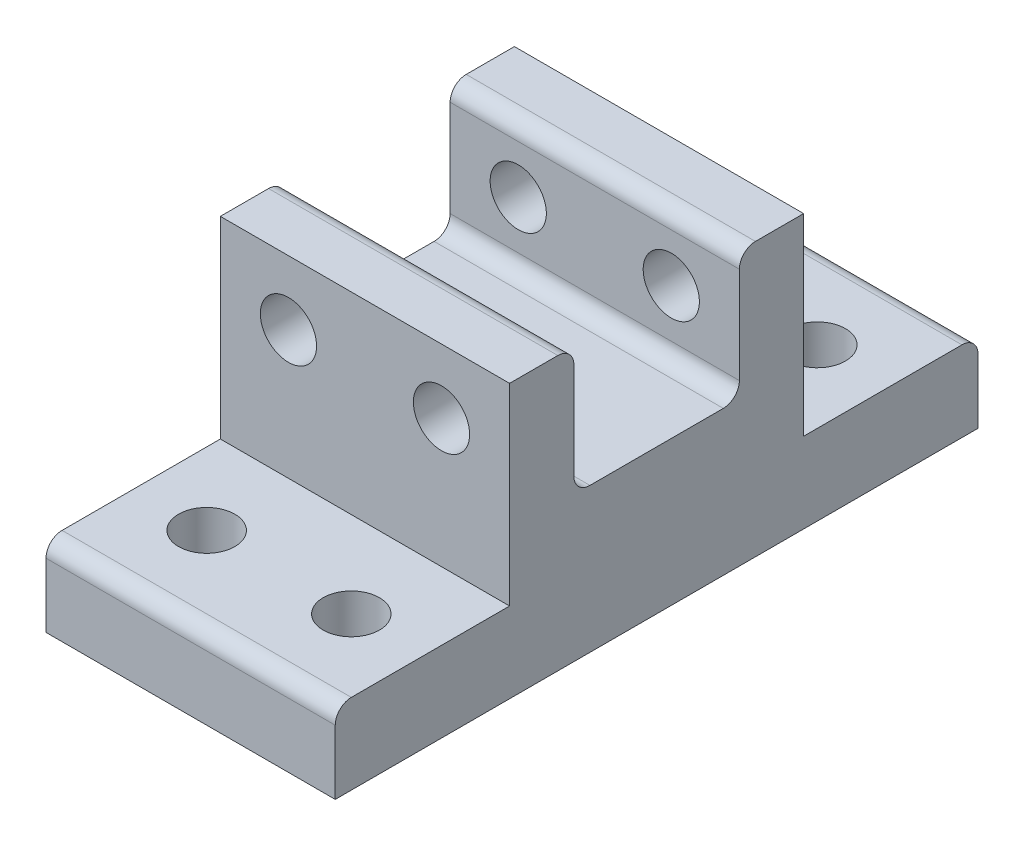
ISO-10303-21;
HEADER;
FILE_DESCRIPTION(('STEP AP214'),'2;1');
FILE_NAME('part.step','',(''),(''),'','','');
FILE_SCHEMA(('AUTOMOTIVE_DESIGN { 1 0 10303 214 1 1 1 1 }'));
ENDSEC;
DATA;
#1=APPLICATION_CONTEXT('core data for automotive mechanical design processes');
#2=APPLICATION_PROTOCOL_DEFINITION('international standard','automotive_design',2000,#1);
#3=PRODUCT_CONTEXT('',#1,'mechanical');
#4=PRODUCT('Part','Part','',(#3));
#5=PRODUCT_RELATED_PRODUCT_CATEGORY('part','',(#4));
#6=PRODUCT_DEFINITION_FORMATION('','',#4);
#7=PRODUCT_DEFINITION_CONTEXT('part definition',#1,'design');
#8=PRODUCT_DEFINITION('design','',#6,#7);
#9=PRODUCT_DEFINITION_SHAPE('','',#8);
#10=(LENGTH_UNIT() NAMED_UNIT(*) SI_UNIT(.MILLI.,.METRE.));
#11=(NAMED_UNIT(*) PLANE_ANGLE_UNIT() SI_UNIT($,.RADIAN.));
#12=(NAMED_UNIT(*) SI_UNIT($,.STERADIAN.) SOLID_ANGLE_UNIT());
#13=UNCERTAINTY_MEASURE_WITH_UNIT(LENGTH_MEASURE(1.E-05),#10,'distance_accuracy_value','');
#14=(GEOMETRIC_REPRESENTATION_CONTEXT(3) GLOBAL_UNCERTAINTY_ASSIGNED_CONTEXT((#13)) GLOBAL_UNIT_ASSIGNED_CONTEXT((#10,
#11,#12)) REPRESENTATION_CONTEXT('',''));
#15=CARTESIAN_POINT('',(0.,0.,0.));
#16=DIRECTION('',(0.,0.,1.));
#17=DIRECTION('',(1.,0.,0.));
#18=AXIS2_PLACEMENT_3D('',#15,#16,#17);
#19=CARTESIAN_POINT('',(0.,3.,0.));
#20=DIRECTION('',(0.,1.,0.));
#21=DIRECTION('',(0.,0.,1.));
#22=AXIS2_PLACEMENT_3D('',#19,#20,#21);
#23=PLANE('',#22);
#24=DIRECTION('',(0.,0.,-1.));
#25=VECTOR('',#24,1.);
#26=CARTESIAN_POINT('',(9.00000000000001,3.,9.15));
#27=LINE('',#26,#25);
#28=CARTESIAN_POINT('',(9.00000000000001,3.,4.15));
#29=VERTEX_POINT('',#28);
#30=CARTESIAN_POINT('',(9.00000000000001,3.,-4.15));
#31=VERTEX_POINT('',#30);
#32=EDGE_CURVE('E238',#29,#31,#27,.T.);
#33=ORIENTED_EDGE('',*,*,#32,.T.);
#34=DIRECTION('',(1.,0.,0.));
#35=VECTOR('',#34,1.);
#36=CARTESIAN_POINT('',(0.,3.,-4.15));
#37=LINE('',#36,#35);
#38=CARTESIAN_POINT('',(-8.99999999999999,3.,-4.15));
#39=VERTEX_POINT('',#38);
#40=EDGE_CURVE('E271',#31,#39,#37,.F.);
#41=ORIENTED_EDGE('',*,*,#40,.T.);
#42=DIRECTION('',(0.,0.,-1.));
#43=VECTOR('',#42,1.);
#44=CARTESIAN_POINT('',(-8.99999999999999,3.,9.15));
#45=LINE('',#44,#43);
#46=CARTESIAN_POINT('',(-8.99999999999999,3.,4.15));
#47=VERTEX_POINT('',#46);
#48=EDGE_CURVE('E241',#47,#39,#45,.T.);
#49=ORIENTED_EDGE('',*,*,#48,.F.);
#50=DIRECTION('',(-1.,0.,0.));
#51=VECTOR('',#50,1.);
#52=CARTESIAN_POINT('',(0.,3.,4.15));
#53=LINE('',#52,#51);
#54=EDGE_CURVE('E261',#47,#29,#53,.F.);
#55=ORIENTED_EDGE('',*,*,#54,.T.);
#56=EDGE_LOOP('',(#33,#41,#49,#55));
#57=FACE_BOUND('',#56,.T.);
#58=ADVANCED_FACE('F35',(#57),#23,.T.);
#59=CARTESIAN_POINT('',(-8.99999999999999,3.,-9.15));
#60=DIRECTION('',(0.,0.,-1.));
#61=DIRECTION('',(-1.,0.,0.));
#62=AXIS2_PLACEMENT_3D('',#59,#60,#61);
#63=PLANE('',#62);
#64=CARTESIAN_POINT('',(4.762,7.,-9.15));
#65=DIRECTION('',(0.,0.,-1.));
#66=DIRECTION('',(-1.,0.,0.));
#67=AXIS2_PLACEMENT_3D('',#64,#65,#66);
#68=CIRCLE('',#67,1.75);
#69=CARTESIAN_POINT('',(3.012,7.,-9.15));
#70=VERTEX_POINT('',#69);
#71=EDGE_CURVE('E211',#70,#70,#68,.F.);
#72=ORIENTED_EDGE('',*,*,#71,.T.);
#73=EDGE_LOOP('',(#72));
#74=FACE_BOUND('',#73,.T.);
#75=CARTESIAN_POINT('',(-4.76200000000001,7.,-9.15));
#76=DIRECTION('',(0.,0.,-1.));
#77=DIRECTION('',(-1.,0.,0.));
#78=AXIS2_PLACEMENT_3D('',#75,#76,#77);
#79=CIRCLE('',#78,1.75);
#80=CARTESIAN_POINT('',(-6.51200000000001,7.,-9.15));
#81=VERTEX_POINT('',#80);
#82=EDGE_CURVE('E201',#81,#81,#79,.F.);
#83=ORIENTED_EDGE('',*,*,#82,.T.);
#84=EDGE_LOOP('',(#83));
#85=FACE_BOUND('',#84,.T.);
#86=DIRECTION('',(0.,-1.,0.));
#87=VECTOR('',#86,1.);
#88=CARTESIAN_POINT('',(9.00000000000001,3.,-9.15));
#89=LINE('',#88,#87);
#90=CARTESIAN_POINT('',(9.00000000000001,11.,-9.15));
#91=VERTEX_POINT('',#90);
#92=CARTESIAN_POINT('',(9.,-1.,-9.15));
#93=VERTEX_POINT('',#92);
#94=EDGE_CURVE('E244',#91,#93,#89,.T.);
#95=ORIENTED_EDGE('',*,*,#94,.T.);
#96=DIRECTION('',(1.,0.,0.));
#97=VECTOR('',#96,1.);
#98=CARTESIAN_POINT('',(-9.,-1.,-9.15));
#99=LINE('',#98,#97);
#100=CARTESIAN_POINT('',(-9.,-1.,-9.15));
#101=VERTEX_POINT('',#100);
#102=EDGE_CURVE('E186',#101,#93,#99,.T.);
#103=ORIENTED_EDGE('',*,*,#102,.F.);
#104=DIRECTION('',(0.,-1.,0.));
#105=VECTOR('',#104,1.);
#106=CARTESIAN_POINT('',(-8.99999999999999,3.,-9.15));
#107=LINE('',#106,#105);
#108=CARTESIAN_POINT('',(-8.99999999999999,11.,-9.15));
#109=VERTEX_POINT('',#108);
#110=EDGE_CURVE('E245',#109,#101,#107,.T.);
#111=ORIENTED_EDGE('',*,*,#110,.F.);
#112=DIRECTION('',(-1.,0.,0.));
#113=VECTOR('',#112,1.);
#114=CARTESIAN_POINT('',(9.00000000000001,11.,-9.15));
#115=LINE('',#114,#113);
#116=EDGE_CURVE('E216',#91,#109,#115,.T.);
#117=ORIENTED_EDGE('',*,*,#116,.F.);
#118=EDGE_LOOP('',(#95,#103,#111,#117));
#119=FACE_BOUND('',#118,.T.);
#120=ADVANCED_FACE('F335',(#74,#85,#119),#63,.T.);
#121=CARTESIAN_POINT('',(-8.99999999999999,3.,9.15));
#122=DIRECTION('',(-1.,0.,0.));
#123=DIRECTION('',(0.,0.,1.));
#124=AXIS2_PLACEMENT_3D('',#121,#122,#123);
#125=PLANE('',#124);
#126=DIRECTION('',(0.,1.,0.));
#127=VECTOR('',#126,1.);
#128=CARTESIAN_POINT('',(-9.,-6.,20.));
#129=LINE('',#128,#127);
#130=CARTESIAN_POINT('',(-9.,-6.,20.));
#131=VERTEX_POINT('',#130);
#132=CARTESIAN_POINT('',(-9.,-2.,20.));
#133=VERTEX_POINT('',#132);
#134=EDGE_CURVE('E166',#131,#133,#129,.T.);
#135=ORIENTED_EDGE('',*,*,#134,.T.);
#136=CARTESIAN_POINT('',(-8.99999999999999,-2.,19.));
#137=DIRECTION('',(-1.,0.,0.));
#138=DIRECTION('',(0.,0.,1.));
#139=AXIS2_PLACEMENT_3D('',#136,#137,#138);
#140=CIRCLE('',#139,1.);
#141=CARTESIAN_POINT('',(-9.,-1.,19.));
#142=VERTEX_POINT('',#141);
#143=EDGE_CURVE('E57',#133,#142,#140,.T.);
#144=ORIENTED_EDGE('',*,*,#143,.T.);
#145=DIRECTION('',(0.,0.,-1.));
#146=VECTOR('',#145,1.);
#147=CARTESIAN_POINT('',(-9.,-1.,20.));
#148=LINE('',#147,#146);
#149=CARTESIAN_POINT('',(-9.,-1.,9.15));
#150=VERTEX_POINT('',#149);
#151=EDGE_CURVE('E179',#142,#150,#148,.T.);
#152=ORIENTED_EDGE('',*,*,#151,.T.);
#153=DIRECTION('',(0.,-1.,0.));
#154=VECTOR('',#153,1.);
#155=CARTESIAN_POINT('',(-8.99999999999999,3.,9.15));
#156=LINE('',#155,#154);
#157=CARTESIAN_POINT('',(-8.99999999999999,11.,9.15));
#158=VERTEX_POINT('',#157);
#159=EDGE_CURVE('E248',#158,#150,#156,.T.);
#160=ORIENTED_EDGE('',*,*,#159,.F.);
#161=DIRECTION('',(0.,0.,1.));
#162=VECTOR('',#161,1.);
#163=CARTESIAN_POINT('',(-8.99999999999999,11.,9.15));
#164=LINE('',#163,#162);
#165=CARTESIAN_POINT('',(-8.99999999999999,11.,6.15));
#166=VERTEX_POINT('',#165);
#167=EDGE_CURVE('E229',#166,#158,#164,.T.);
#168=ORIENTED_EDGE('',*,*,#167,.F.);
#169=CARTESIAN_POINT('',(-8.99999999999999,10.,6.15));
#170=DIRECTION('',(-1.,0.,0.));
#171=DIRECTION('',(0.,0.,1.));
#172=AXIS2_PLACEMENT_3D('',#169,#170,#171);
#173=CIRCLE('',#172,1.);
#174=CARTESIAN_POINT('',(-8.99999999999999,10.,5.15));
#175=VERTEX_POINT('',#174);
#176=EDGE_CURVE('E287',#166,#175,#173,.T.);
#177=ORIENTED_EDGE('',*,*,#176,.T.);
#178=DIRECTION('',(0.,-1.,0.));
#179=VECTOR('',#178,1.);
#180=CARTESIAN_POINT('',(-8.99999999999999,11.,5.15));
#181=LINE('',#180,#179);
#182=CARTESIAN_POINT('',(-8.99999999999999,4.,5.15));
#183=VERTEX_POINT('',#182);
#184=EDGE_CURVE('E234',#175,#183,#181,.T.);
#185=ORIENTED_EDGE('',*,*,#184,.T.);
#186=CARTESIAN_POINT('',(-8.99999999999999,4.,4.15));
#187=DIRECTION('',(-1.,0.,0.));
#188=DIRECTION('',(0.,0.,1.));
#189=AXIS2_PLACEMENT_3D('',#186,#187,#188);
#190=CIRCLE('',#189,1.);
#191=EDGE_CURVE('E263',#183,#47,#190,.F.);
#192=ORIENTED_EDGE('',*,*,#191,.T.);
#193=ORIENTED_EDGE('',*,*,#48,.T.);
#194=CARTESIAN_POINT('',(-8.99999999999999,4.,-4.15));
#195=DIRECTION('',(-1.,0.,0.));
#196=DIRECTION('',(0.,0.,1.));
#197=AXIS2_PLACEMENT_3D('',#194,#195,#196);
#198=CIRCLE('',#197,1.);
#199=CARTESIAN_POINT('',(-8.99999999999999,4.,-5.15));
#200=VERTEX_POINT('',#199);
#201=EDGE_CURVE('E275',#39,#200,#198,.F.);
#202=ORIENTED_EDGE('',*,*,#201,.T.);
#203=DIRECTION('',(0.,-1.,0.));
#204=VECTOR('',#203,1.);
#205=CARTESIAN_POINT('',(-8.99999999999999,11.,-5.15));
#206=LINE('',#205,#204);
#207=CARTESIAN_POINT('',(-8.99999999999999,10.,-5.15));
#208=VERTEX_POINT('',#207);
#209=EDGE_CURVE('E224',#208,#200,#206,.T.);
#210=ORIENTED_EDGE('',*,*,#209,.F.);
#211=CARTESIAN_POINT('',(-8.99999999999999,10.,-6.15));
#212=DIRECTION('',(-1.,0.,0.));
#213=DIRECTION('',(0.,0.,1.));
#214=AXIS2_PLACEMENT_3D('',#211,#212,#213);
#215=CIRCLE('',#214,1.);
#216=CARTESIAN_POINT('',(-8.99999999999999,11.,-6.15));
#217=VERTEX_POINT('',#216);
#218=EDGE_CURVE('E289',#208,#217,#215,.T.);
#219=ORIENTED_EDGE('',*,*,#218,.T.);
#220=DIRECTION('',(0.,0.,1.));
#221=VECTOR('',#220,1.);
#222=CARTESIAN_POINT('',(-8.99999999999999,11.,-9.15));
#223=LINE('',#222,#221);
#224=EDGE_CURVE('E219',#109,#217,#223,.T.);
#225=ORIENTED_EDGE('',*,*,#224,.F.);
#226=ORIENTED_EDGE('',*,*,#110,.T.);
#227=CARTESIAN_POINT('',(-9.,-1.,-19.));
#228=VERTEX_POINT('',#227);
#229=EDGE_CURVE('E317',#101,#228,#148,.T.);
#230=ORIENTED_EDGE('',*,*,#229,.T.);
#231=CARTESIAN_POINT('',(-8.99999999999999,-2.,-19.));
#232=DIRECTION('',(-1.,0.,0.));
#233=DIRECTION('',(0.,0.,1.));
#234=AXIS2_PLACEMENT_3D('',#231,#232,#233);
#235=CIRCLE('',#234,1.);
#236=CARTESIAN_POINT('',(-9.,-2.,-20.));
#237=VERTEX_POINT('',#236);
#238=EDGE_CURVE('E303',#228,#237,#235,.T.);
#239=ORIENTED_EDGE('',*,*,#238,.T.);
#240=DIRECTION('',(0.,1.,0.));
#241=VECTOR('',#240,1.);
#242=CARTESIAN_POINT('',(-9.,-6.,-20.));
#243=LINE('',#242,#241);
#244=CARTESIAN_POINT('',(-9.,-6.,-20.));
#245=VERTEX_POINT('',#244);
#246=EDGE_CURVE('E188',#245,#237,#243,.T.);
#247=ORIENTED_EDGE('',*,*,#246,.F.);
#248=DIRECTION('',(0.,0.,-1.));
#249=VECTOR('',#248,1.);
#250=CARTESIAN_POINT('',(-9.,-6.,20.));
#251=LINE('',#250,#249);
#252=EDGE_CURVE('E169',#131,#245,#251,.T.);
#253=ORIENTED_EDGE('',*,*,#252,.F.);
#254=EDGE_LOOP('',(#135,#144,#152,#160,#168,#177,#185,#192,#193,#202,#210,#219,#225,#226,#230,
#239,#247,#253));
#255=FACE_BOUND('',#254,.T.);
#256=ADVANCED_FACE('F308',(#255),#125,.T.);
#257=CARTESIAN_POINT('',(-8.99999999999999,3.,9.15));
#258=DIRECTION('',(0.,0.,-1.));
#259=DIRECTION('',(-1.,0.,0.));
#260=AXIS2_PLACEMENT_3D('',#257,#258,#259);
#261=PLANE('',#260);
#262=CARTESIAN_POINT('',(4.762,7.,9.15));
#263=DIRECTION('',(0.,0.,-1.));
#264=DIRECTION('',(-1.,0.,0.));
#265=AXIS2_PLACEMENT_3D('',#262,#263,#264);
#266=CIRCLE('',#265,1.75);
#267=CARTESIAN_POINT('',(3.01200000000001,7.,9.15));
#268=VERTEX_POINT('',#267);
#269=EDGE_CURVE('E208',#268,#268,#266,.F.);
#270=ORIENTED_EDGE('',*,*,#269,.F.);
#271=EDGE_LOOP('',(#270));
#272=FACE_BOUND('',#271,.T.);
#273=CARTESIAN_POINT('',(-4.762,7.,9.15));
#274=DIRECTION('',(0.,0.,-1.));
#275=DIRECTION('',(-1.,0.,0.));
#276=AXIS2_PLACEMENT_3D('',#273,#274,#275);
#277=CIRCLE('',#276,1.75);
#278=CARTESIAN_POINT('',(-6.512,7.,9.15));
#279=VERTEX_POINT('',#278);
#280=EDGE_CURVE('E198',#279,#279,#277,.F.);
#281=ORIENTED_EDGE('',*,*,#280,.F.);
#282=EDGE_LOOP('',(#281));
#283=FACE_BOUND('',#282,.T.);
#284=ORIENTED_EDGE('',*,*,#159,.T.);
#285=DIRECTION('',(-1.,0.,0.));
#286=VECTOR('',#285,1.);
#287=CARTESIAN_POINT('',(-9.,-1.,9.15));
#288=LINE('',#287,#286);
#289=CARTESIAN_POINT('',(9.00000000000001,-1.,9.15));
#290=VERTEX_POINT('',#289);
#291=EDGE_CURVE('E183',#290,#150,#288,.T.);
#292=ORIENTED_EDGE('',*,*,#291,.F.);
#293=DIRECTION('',(0.,-1.,0.));
#294=VECTOR('',#293,1.);
#295=CARTESIAN_POINT('',(9.00000000000001,3.,9.15));
#296=LINE('',#295,#294);
#297=CARTESIAN_POINT('',(9.00000000000001,11.,9.15));
#298=VERTEX_POINT('',#297);
#299=EDGE_CURVE('E251',#298,#290,#296,.T.);
#300=ORIENTED_EDGE('',*,*,#299,.F.);
#301=DIRECTION('',(1.,0.,0.));
#302=VECTOR('',#301,1.);
#303=CARTESIAN_POINT('',(9.00000000000001,11.,9.15));
#304=LINE('',#303,#302);
#305=EDGE_CURVE('E231',#158,#298,#304,.T.);
#306=ORIENTED_EDGE('',*,*,#305,.F.);
#307=EDGE_LOOP('',(#284,#292,#300,#306));
#308=FACE_BOUND('',#307,.T.);
#309=ADVANCED_FACE('F381',(#272,#283,#308),#261,.F.);
#310=CARTESIAN_POINT('',(9.00000000000001,3.,9.15));
#311=DIRECTION('',(-1.,0.,0.));
#312=DIRECTION('',(0.,0.,1.));
#313=AXIS2_PLACEMENT_3D('',#310,#311,#312);
#314=PLANE('',#313);
#315=DIRECTION('',(0.,0.,1.));
#316=VECTOR('',#315,1.);
#317=CARTESIAN_POINT('',(9.,-1.,20.));
#318=LINE('',#317,#316);
#319=CARTESIAN_POINT('',(9.,-1.,19.));
#320=VERTEX_POINT('',#319);
#321=EDGE_CURVE('E318',#290,#320,#318,.T.);
#322=ORIENTED_EDGE('',*,*,#321,.T.);
#323=CARTESIAN_POINT('',(9.,-2.,19.));
#324=DIRECTION('',(-1.,0.,0.));
#325=DIRECTION('',(0.,0.,1.));
#326=AXIS2_PLACEMENT_3D('',#323,#324,#325);
#327=CIRCLE('',#326,1.);
#328=CARTESIAN_POINT('',(9.,-2.,20.));
#329=VERTEX_POINT('',#328);
#330=EDGE_CURVE('E12',#320,#329,#327,.F.);
#331=ORIENTED_EDGE('',*,*,#330,.T.);
#332=DIRECTION('',(0.,1.,0.));
#333=VECTOR('',#332,1.);
#334=CARTESIAN_POINT('',(9.,-6.,20.));
#335=LINE('',#334,#333);
#336=CARTESIAN_POINT('',(9.,-6.,20.));
#337=VERTEX_POINT('',#336);
#338=EDGE_CURVE('E164',#337,#329,#335,.T.);
#339=ORIENTED_EDGE('',*,*,#338,.F.);
#340=DIRECTION('',(0.,0.,1.));
#341=VECTOR('',#340,1.);
#342=CARTESIAN_POINT('',(9.,-6.,20.));
#343=LINE('',#342,#341);
#344=CARTESIAN_POINT('',(9.,-6.,-20.));
#345=VERTEX_POINT('',#344);
#346=EDGE_CURVE('E170',#345,#337,#343,.T.);
#347=ORIENTED_EDGE('',*,*,#346,.F.);
#348=DIRECTION('',(0.,1.,0.));
#349=VECTOR('',#348,1.);
#350=CARTESIAN_POINT('',(9.,-6.,-20.));
#351=LINE('',#350,#349);
#352=CARTESIAN_POINT('',(9.,-2.,-20.));
#353=VERTEX_POINT('',#352);
#354=EDGE_CURVE('E312',#345,#353,#351,.T.);
#355=ORIENTED_EDGE('',*,*,#354,.T.);
#356=CARTESIAN_POINT('',(9.,-2.,-19.));
#357=DIRECTION('',(-1.,0.,0.));
#358=DIRECTION('',(0.,0.,1.));
#359=AXIS2_PLACEMENT_3D('',#356,#357,#358);
#360=CIRCLE('',#359,1.);
#361=CARTESIAN_POINT('',(9.,-1.,-19.));
#362=VERTEX_POINT('',#361);
#363=EDGE_CURVE('E299',#353,#362,#360,.F.);
#364=ORIENTED_EDGE('',*,*,#363,.T.);
#365=EDGE_CURVE('E315',#362,#93,#318,.T.);
#366=ORIENTED_EDGE('',*,*,#365,.T.);
#367=ORIENTED_EDGE('',*,*,#94,.F.);
#368=DIRECTION('',(0.,0.,-1.));
#369=VECTOR('',#368,1.);
#370=CARTESIAN_POINT('',(9.00000000000001,11.,-9.15));
#371=LINE('',#370,#369);
#372=CARTESIAN_POINT('',(9.00000000000001,11.,-6.15));
#373=VERTEX_POINT('',#372);
#374=EDGE_CURVE('E214',#373,#91,#371,.T.);
#375=ORIENTED_EDGE('',*,*,#374,.F.);
#376=CARTESIAN_POINT('',(9.00000000000001,10.,-6.15));
#377=DIRECTION('',(-1.,0.,0.));
#378=DIRECTION('',(0.,0.,1.));
#379=AXIS2_PLACEMENT_3D('',#376,#377,#378);
#380=CIRCLE('',#379,1.);
#381=CARTESIAN_POINT('',(9.00000000000001,10.,-5.15));
#382=VERTEX_POINT('',#381);
#383=EDGE_CURVE('E283',#373,#382,#380,.F.);
#384=ORIENTED_EDGE('',*,*,#383,.T.);
#385=DIRECTION('',(0.,-1.,0.));
#386=VECTOR('',#385,1.);
#387=CARTESIAN_POINT('',(9.00000000000001,11.,-5.15));
#388=LINE('',#387,#386);
#389=CARTESIAN_POINT('',(9.00000000000001,4.,-5.15));
#390=VERTEX_POINT('',#389);
#391=EDGE_CURVE('E222',#382,#390,#388,.T.);
#392=ORIENTED_EDGE('',*,*,#391,.T.);
#393=CARTESIAN_POINT('',(9.00000000000001,4.,-4.15));
#394=DIRECTION('',(-1.,0.,0.));
#395=DIRECTION('',(0.,0.,1.));
#396=AXIS2_PLACEMENT_3D('',#393,#394,#395);
#397=CIRCLE('',#396,1.);
#398=EDGE_CURVE('E273',#390,#31,#397,.T.);
#399=ORIENTED_EDGE('',*,*,#398,.T.);
#400=ORIENTED_EDGE('',*,*,#32,.F.);
#401=CARTESIAN_POINT('',(9.00000000000001,4.,4.15));
#402=DIRECTION('',(-1.,0.,0.));
#403=DIRECTION('',(0.,0.,1.));
#404=AXIS2_PLACEMENT_3D('',#401,#402,#403);
#405=CIRCLE('',#404,1.);
#406=CARTESIAN_POINT('',(9.00000000000001,4.,5.15));
#407=VERTEX_POINT('',#406);
#408=EDGE_CURVE('E265',#29,#407,#405,.T.);
#409=ORIENTED_EDGE('',*,*,#408,.T.);
#410=DIRECTION('',(0.,-1.,0.));
#411=VECTOR('',#410,1.);
#412=CARTESIAN_POINT('',(9.00000000000001,11.,5.15));
#413=LINE('',#412,#411);
#414=CARTESIAN_POINT('',(9.00000000000001,10.,5.15));
#415=VERTEX_POINT('',#414);
#416=EDGE_CURVE('E236',#415,#407,#413,.T.);
#417=ORIENTED_EDGE('',*,*,#416,.F.);
#418=CARTESIAN_POINT('',(9.00000000000001,10.,6.15));
#419=DIRECTION('',(-1.,0.,0.));
#420=DIRECTION('',(0.,0.,1.));
#421=AXIS2_PLACEMENT_3D('',#418,#419,#420);
#422=CIRCLE('',#421,1.);
#423=CARTESIAN_POINT('',(9.00000000000001,11.,6.15));
#424=VERTEX_POINT('',#423);
#425=EDGE_CURVE('E281',#415,#424,#422,.F.);
#426=ORIENTED_EDGE('',*,*,#425,.T.);
#427=DIRECTION('',(0.,0.,-1.));
#428=VECTOR('',#427,1.);
#429=CARTESIAN_POINT('',(9.00000000000001,11.,9.15));
#430=LINE('',#429,#428);
#431=EDGE_CURVE('E226',#298,#424,#430,.T.);
#432=ORIENTED_EDGE('',*,*,#431,.F.);
#433=ORIENTED_EDGE('',*,*,#299,.T.);
#434=EDGE_LOOP('',(#322,#331,#339,#347,#355,#364,#366,#367,#375,#384,#392,#399,#400,#409,#417,
#426,#432,#433));
#435=FACE_BOUND('',#434,.T.);
#436=ADVANCED_FACE('F181',(#435),#314,.F.);
#437=CARTESIAN_POINT('',(9.00000000000001,11.,5.15));
#438=DIRECTION('',(0.,0.,1.));
#439=DIRECTION('',(1.,0.,0.));
#440=AXIS2_PLACEMENT_3D('',#437,#438,#439);
#441=PLANE('',#440);
#442=CARTESIAN_POINT('',(4.762,7.,5.15));
#443=DIRECTION('',(0.,0.,1.));
#444=DIRECTION('',(1.,0.,0.));
#445=AXIS2_PLACEMENT_3D('',#442,#443,#444);
#446=CIRCLE('',#445,1.75);
#447=CARTESIAN_POINT('',(6.512,7.,5.15));
#448=VERTEX_POINT('',#447);
#449=EDGE_CURVE('E205',#448,#448,#446,.F.);
#450=ORIENTED_EDGE('',*,*,#449,.F.);
#451=EDGE_LOOP('',(#450));
#452=FACE_BOUND('',#451,.T.);
#453=CARTESIAN_POINT('',(-4.762,7.,5.15));
#454=DIRECTION('',(0.,0.,1.));
#455=DIRECTION('',(1.,0.,0.));
#456=AXIS2_PLACEMENT_3D('',#453,#454,#455);
#457=CIRCLE('',#456,1.75);
#458=CARTESIAN_POINT('',(-3.012,7.,5.15));
#459=VERTEX_POINT('',#458);
#460=EDGE_CURVE('E195',#459,#459,#457,.F.);
#461=ORIENTED_EDGE('',*,*,#460,.F.);
#462=EDGE_LOOP('',(#461));
#463=FACE_BOUND('',#462,.T.);
#464=ORIENTED_EDGE('',*,*,#184,.F.);
#465=DIRECTION('',(-1.,0.,0.));
#466=VECTOR('',#465,1.);
#467=CARTESIAN_POINT('',(9.00000000000001,10.,5.15));
#468=LINE('',#467,#466);
#469=EDGE_CURVE('E294',#175,#415,#468,.F.);
#470=ORIENTED_EDGE('',*,*,#469,.T.);
#471=ORIENTED_EDGE('',*,*,#416,.T.);
#472=DIRECTION('',(-1.,0.,0.));
#473=VECTOR('',#472,1.);
#474=CARTESIAN_POINT('',(9.00000000000001,4.,5.15));
#475=LINE('',#474,#473);
#476=EDGE_CURVE('E247',#407,#183,#475,.T.);
#477=ORIENTED_EDGE('',*,*,#476,.T.);
#478=EDGE_LOOP('',(#464,#470,#471,#477));
#479=FACE_BOUND('',#478,.T.);
#480=ADVANCED_FACE('F441',(#452,#463,#479),#441,.F.);
#481=CARTESIAN_POINT('',(0.,11.,0.));
#482=DIRECTION('',(0.,1.,0.));
#483=DIRECTION('',(0.,0.,1.));
#484=AXIS2_PLACEMENT_3D('',#481,#482,#483);
#485=PLANE('',#484);
#486=ORIENTED_EDGE('',*,*,#431,.T.);
#487=DIRECTION('',(-1.,0.,0.));
#488=VECTOR('',#487,1.);
#489=CARTESIAN_POINT('',(-8.99999999999999,11.,6.15));
#490=LINE('',#489,#488);
#491=EDGE_CURVE('E291',#424,#166,#490,.T.);
#492=ORIENTED_EDGE('',*,*,#491,.T.);
#493=ORIENTED_EDGE('',*,*,#167,.T.);
#494=ORIENTED_EDGE('',*,*,#305,.T.);
#495=EDGE_LOOP('',(#486,#492,#493,#494));
#496=FACE_BOUND('',#495,.T.);
#497=ADVANCED_FACE('F375',(#496),#485,.T.);
#498=CARTESIAN_POINT('',(9.00000000000001,11.,-5.15));
#499=DIRECTION('',(0.,0.,-1.));
#500=DIRECTION('',(-1.,0.,0.));
#501=AXIS2_PLACEMENT_3D('',#498,#499,#500);
#502=PLANE('',#501);
#503=CARTESIAN_POINT('',(4.762,7.,-5.15));
#504=DIRECTION('',(0.,0.,-1.));
#505=DIRECTION('',(-1.,0.,0.));
#506=AXIS2_PLACEMENT_3D('',#503,#504,#505);
#507=CIRCLE('',#506,1.75);
#508=CARTESIAN_POINT('',(3.012,7.,-5.15));
#509=VERTEX_POINT('',#508);
#510=EDGE_CURVE('E204',#509,#509,#507,.F.);
#511=ORIENTED_EDGE('',*,*,#510,.F.);
#512=EDGE_LOOP('',(#511));
#513=FACE_BOUND('',#512,.T.);
#514=CARTESIAN_POINT('',(-4.762,7.,-5.15));
#515=DIRECTION('',(0.,0.,-1.));
#516=DIRECTION('',(-1.,0.,0.));
#517=AXIS2_PLACEMENT_3D('',#514,#515,#516);
#518=CIRCLE('',#517,1.75);
#519=CARTESIAN_POINT('',(-6.512,7.,-5.15));
#520=VERTEX_POINT('',#519);
#521=EDGE_CURVE('E194',#520,#520,#518,.F.);
#522=ORIENTED_EDGE('',*,*,#521,.F.);
#523=EDGE_LOOP('',(#522));
#524=FACE_BOUND('',#523,.T.);
#525=ORIENTED_EDGE('',*,*,#391,.F.);
#526=DIRECTION('',(1.,0.,0.));
#527=VECTOR('',#526,1.);
#528=CARTESIAN_POINT('',(9.00000000000001,10.,-5.15));
#529=LINE('',#528,#527);
#530=EDGE_CURVE('E285',#382,#208,#529,.F.);
#531=ORIENTED_EDGE('',*,*,#530,.T.);
#532=ORIENTED_EDGE('',*,*,#209,.T.);
#533=DIRECTION('',(1.,0.,0.));
#534=VECTOR('',#533,1.);
#535=CARTESIAN_POINT('',(9.00000000000001,4.,-5.15));
#536=LINE('',#535,#534);
#537=EDGE_CURVE('E268',#200,#390,#536,.T.);
#538=ORIENTED_EDGE('',*,*,#537,.T.);
#539=EDGE_LOOP('',(#525,#531,#532,#538));
#540=FACE_BOUND('',#539,.T.);
#541=ADVANCED_FACE('F349',(#513,#524,#540),#502,.F.);
#542=CARTESIAN_POINT('',(0.,11.,0.));
#543=DIRECTION('',(0.,-1.,0.));
#544=DIRECTION('',(0.,0.,-1.));
#545=AXIS2_PLACEMENT_3D('',#542,#543,#544);
#546=PLANE('',#545);
#547=ORIENTED_EDGE('',*,*,#224,.T.);
#548=DIRECTION('',(1.,0.,0.));
#549=VECTOR('',#548,1.);
#550=CARTESIAN_POINT('',(0.,11.,-6.15));
#551=LINE('',#550,#549);
#552=EDGE_CURVE('E278',#217,#373,#551,.T.);
#553=ORIENTED_EDGE('',*,*,#552,.T.);
#554=ORIENTED_EDGE('',*,*,#374,.T.);
#555=ORIENTED_EDGE('',*,*,#116,.T.);
#556=EDGE_LOOP('',(#547,#553,#554,#555));
#557=FACE_BOUND('',#556,.T.);
#558=ADVANCED_FACE('F340',(#557),#546,.F.);
#559=CARTESIAN_POINT('',(-4.76200000000001,7.,-14.85));
#560=DIRECTION('',(0.,0.,1.));
#561=DIRECTION('',(1.,0.,0.));
#562=AXIS2_PLACEMENT_3D('',#559,#560,#561);
#563=CYLINDRICAL_SURFACE('',#562,1.75);
#564=ORIENTED_EDGE('',*,*,#82,.F.);
#565=EDGE_LOOP('',(#564));
#566=FACE_BOUND('',#565,.T.);
#567=ORIENTED_EDGE('',*,*,#521,.T.);
#568=EDGE_LOOP('',(#567));
#569=FACE_BOUND('',#568,.T.);
#570=ADVANCED_FACE('F497',(#566,#569),#563,.F.);
#571=CARTESIAN_POINT('',(4.762,7.,-14.85));
#572=DIRECTION('',(0.,0.,1.));
#573=DIRECTION('',(1.,0.,0.));
#574=AXIS2_PLACEMENT_3D('',#571,#572,#573);
#575=CYLINDRICAL_SURFACE('',#574,1.75);
#576=ORIENTED_EDGE('',*,*,#71,.F.);
#577=EDGE_LOOP('',(#576));
#578=FACE_BOUND('',#577,.T.);
#579=ORIENTED_EDGE('',*,*,#510,.T.);
#580=EDGE_LOOP('',(#579));
#581=FACE_BOUND('',#580,.T.);
#582=ADVANCED_FACE('F493',(#578,#581),#575,.F.);
#583=ORIENTED_EDGE('',*,*,#460,.T.);
#584=EDGE_LOOP('',(#583));
#585=FACE_BOUND('',#584,.T.);
#586=ORIENTED_EDGE('',*,*,#280,.T.);
#587=EDGE_LOOP('',(#586));
#588=FACE_BOUND('',#587,.T.);
#589=ADVANCED_FACE('F491',(#585,#588),#563,.F.);
#590=ORIENTED_EDGE('',*,*,#449,.T.);
#591=EDGE_LOOP('',(#590));
#592=FACE_BOUND('',#591,.T.);
#593=ORIENTED_EDGE('',*,*,#269,.T.);
#594=EDGE_LOOP('',(#593));
#595=FACE_BOUND('',#594,.T.);
#596=ADVANCED_FACE('F452',(#592,#595),#575,.F.);
#597=CARTESIAN_POINT('',(9.00000000000001,4.,4.15));
#598=DIRECTION('',(-1.,0.,0.));
#599=DIRECTION('',(0.,0.,1.));
#600=AXIS2_PLACEMENT_3D('',#597,#598,#599);
#601=CYLINDRICAL_SURFACE('',#600,1.);
#602=ORIENTED_EDGE('',*,*,#408,.F.);
#603=ORIENTED_EDGE('',*,*,#54,.F.);
#604=ORIENTED_EDGE('',*,*,#191,.F.);
#605=ORIENTED_EDGE('',*,*,#476,.F.);
#606=EDGE_LOOP('',(#602,#603,#604,#605));
#607=FACE_BOUND('',#606,.T.);
#608=ADVANCED_FACE('F363',(#607),#601,.F.);
#609=CARTESIAN_POINT('',(9.00000000000001,4.,-4.15));
#610=DIRECTION('',(1.,0.,0.));
#611=DIRECTION('',(0.,0.,-1.));
#612=AXIS2_PLACEMENT_3D('',#609,#610,#611);
#613=CYLINDRICAL_SURFACE('',#612,1.);
#614=ORIENTED_EDGE('',*,*,#201,.F.);
#615=ORIENTED_EDGE('',*,*,#40,.F.);
#616=ORIENTED_EDGE('',*,*,#398,.F.);
#617=ORIENTED_EDGE('',*,*,#537,.F.);
#618=EDGE_LOOP('',(#614,#615,#616,#617));
#619=FACE_BOUND('',#618,.T.);
#620=ADVANCED_FACE('F356',(#619),#613,.F.);
#621=CARTESIAN_POINT('',(0.,10.,-6.15));
#622=DIRECTION('',(1.,0.,0.));
#623=DIRECTION('',(0.,0.,-1.));
#624=AXIS2_PLACEMENT_3D('',#621,#622,#623);
#625=CYLINDRICAL_SURFACE('',#624,1.);
#626=ORIENTED_EDGE('',*,*,#218,.F.);
#627=ORIENTED_EDGE('',*,*,#530,.F.);
#628=ORIENTED_EDGE('',*,*,#383,.F.);
#629=ORIENTED_EDGE('',*,*,#552,.F.);
#630=EDGE_LOOP('',(#626,#627,#628,#629));
#631=FACE_BOUND('',#630,.T.);
#632=ADVANCED_FACE('F345',(#631),#625,.T.);
#633=CARTESIAN_POINT('',(0.,10.,6.15));
#634=DIRECTION('',(1.,0.,0.));
#635=DIRECTION('',(0.,0.,-1.));
#636=AXIS2_PLACEMENT_3D('',#633,#634,#635);
#637=CYLINDRICAL_SURFACE('',#636,1.);
#638=ORIENTED_EDGE('',*,*,#425,.F.);
#639=ORIENTED_EDGE('',*,*,#469,.F.);
#640=ORIENTED_EDGE('',*,*,#176,.F.);
#641=ORIENTED_EDGE('',*,*,#491,.F.);
#642=EDGE_LOOP('',(#638,#639,#640,#641));
#643=FACE_BOUND('',#642,.T.);
#644=ADVANCED_FACE('F372',(#643),#637,.T.);
#645=CARTESIAN_POINT('',(0.,-1.,0.));
#646=DIRECTION('',(0.,-1.,0.));
#647=DIRECTION('',(0.,0.,-1.));
#648=AXIS2_PLACEMENT_3D('',#645,#646,#647);
#649=PLANE('',#648);
#650=CARTESIAN_POINT('',(-4.5,-1.,14.5));
#651=DIRECTION('',(0.,-1.,0.));
#652=DIRECTION('',(0.,0.,1.));
#653=AXIS2_PLACEMENT_3D('',#650,#651,#652);
#654=CIRCLE('',#653,1.75);
#655=CARTESIAN_POINT('',(-4.5,-1.,16.25));
#656=VERTEX_POINT('',#655);
#657=EDGE_CURVE('E390',#656,#656,#654,.T.);
#658=ORIENTED_EDGE('',*,*,#657,.T.);
#659=EDGE_LOOP('',(#658));
#660=FACE_BOUND('',#659,.T.);
#661=CARTESIAN_POINT('',(4.5,-1.,14.5));
#662=DIRECTION('',(0.,-1.,0.));
#663=DIRECTION('',(0.,0.,-1.));
#664=AXIS2_PLACEMENT_3D('',#661,#662,#663);
#665=CIRCLE('',#664,1.75);
#666=CARTESIAN_POINT('',(4.5,-1.,12.75));
#667=VERTEX_POINT('',#666);
#668=EDGE_CURVE('E383',#667,#667,#665,.T.);
#669=ORIENTED_EDGE('',*,*,#668,.T.);
#670=EDGE_LOOP('',(#669));
#671=FACE_BOUND('',#670,.T.);
#672=ORIENTED_EDGE('',*,*,#151,.F.);
#673=DIRECTION('',(-1.,0.,0.));
#674=VECTOR('',#673,1.);
#675=CARTESIAN_POINT('',(0.,-1.,19.));
#676=LINE('',#675,#674);
#677=EDGE_CURVE('E43',#142,#320,#676,.F.);
#678=ORIENTED_EDGE('',*,*,#677,.T.);
#679=ORIENTED_EDGE('',*,*,#321,.F.);
#680=ORIENTED_EDGE('',*,*,#291,.T.);
#681=EDGE_LOOP('',(#672,#678,#679,#680));
#682=FACE_BOUND('',#681,.T.);
#683=ADVANCED_FACE('F382',(#660,#671,#682),#649,.F.);
#684=CARTESIAN_POINT('',(4.5,-1.,-14.5));
#685=DIRECTION('',(0.,-1.,0.));
#686=DIRECTION('',(0.,0.,1.));
#687=AXIS2_PLACEMENT_3D('',#684,#685,#686);
#688=CIRCLE('',#687,1.75);
#689=CARTESIAN_POINT('',(4.5,-1.,-12.75));
#690=VERTEX_POINT('',#689);
#691=EDGE_CURVE('E396',#690,#690,#688,.T.);
#692=ORIENTED_EDGE('',*,*,#691,.T.);
#693=EDGE_LOOP('',(#692));
#694=FACE_BOUND('',#693,.T.);
#695=CARTESIAN_POINT('',(-4.5,-1.,-14.5));
#696=DIRECTION('',(0.,-1.,0.));
#697=DIRECTION('',(0.,0.,-1.));
#698=AXIS2_PLACEMENT_3D('',#695,#696,#697);
#699=CIRCLE('',#698,1.75);
#700=CARTESIAN_POINT('',(-4.5,-1.,-16.25));
#701=VERTEX_POINT('',#700);
#702=EDGE_CURVE('E402',#701,#701,#699,.T.);
#703=ORIENTED_EDGE('',*,*,#702,.T.);
#704=EDGE_LOOP('',(#703));
#705=FACE_BOUND('',#704,.T.);
#706=ORIENTED_EDGE('',*,*,#365,.F.);
#707=DIRECTION('',(1.,0.,0.));
#708=VECTOR('',#707,1.);
#709=CARTESIAN_POINT('',(0.,-1.,-19.));
#710=LINE('',#709,#708);
#711=EDGE_CURVE('E301',#362,#228,#710,.F.);
#712=ORIENTED_EDGE('',*,*,#711,.T.);
#713=ORIENTED_EDGE('',*,*,#229,.F.);
#714=ORIENTED_EDGE('',*,*,#102,.T.);
#715=EDGE_LOOP('',(#706,#712,#713,#714));
#716=FACE_BOUND('',#715,.T.);
#717=ADVANCED_FACE('F330',(#694,#705,#716),#649,.F.);
#718=CARTESIAN_POINT('',(-9.,-6.,20.));
#719=DIRECTION('',(0.,0.,-1.));
#720=DIRECTION('',(-1.,0.,0.));
#721=AXIS2_PLACEMENT_3D('',#718,#719,#720);
#722=PLANE('',#721);
#723=ORIENTED_EDGE('',*,*,#338,.T.);
#724=DIRECTION('',(-1.,0.,0.));
#725=VECTOR('',#724,1.);
#726=CARTESIAN_POINT('',(-9.,-2.,20.));
#727=LINE('',#726,#725);
#728=EDGE_CURVE('E305',#329,#133,#727,.T.);
#729=ORIENTED_EDGE('',*,*,#728,.T.);
#730=ORIENTED_EDGE('',*,*,#134,.F.);
#731=DIRECTION('',(-1.,0.,0.));
#732=VECTOR('',#731,1.);
#733=CARTESIAN_POINT('',(-9.,-6.,20.));
#734=LINE('',#733,#732);
#735=EDGE_CURVE('E159',#337,#131,#734,.T.);
#736=ORIENTED_EDGE('',*,*,#735,.F.);
#737=EDGE_LOOP('',(#723,#729,#730,#736));
#738=FACE_BOUND('',#737,.T.);
#739=ADVANCED_FACE('F161',(#738),#722,.F.);
#740=CARTESIAN_POINT('',(-9.,-6.,-20.));
#741=DIRECTION('',(0.,0.,1.));
#742=DIRECTION('',(1.,0.,0.));
#743=AXIS2_PLACEMENT_3D('',#740,#741,#742);
#744=PLANE('',#743);
#745=ORIENTED_EDGE('',*,*,#246,.T.);
#746=DIRECTION('',(1.,0.,0.));
#747=VECTOR('',#746,1.);
#748=CARTESIAN_POINT('',(-9.,-2.,-20.));
#749=LINE('',#748,#747);
#750=EDGE_CURVE('E296',#237,#353,#749,.T.);
#751=ORIENTED_EDGE('',*,*,#750,.T.);
#752=ORIENTED_EDGE('',*,*,#354,.F.);
#753=DIRECTION('',(1.,0.,0.));
#754=VECTOR('',#753,1.);
#755=CARTESIAN_POINT('',(-9.,-6.,-20.));
#756=LINE('',#755,#754);
#757=EDGE_CURVE('E175',#245,#345,#756,.T.);
#758=ORIENTED_EDGE('',*,*,#757,.F.);
#759=EDGE_LOOP('',(#745,#751,#752,#758));
#760=FACE_BOUND('',#759,.T.);
#761=ADVANCED_FACE('F322',(#760),#744,.F.);
#762=CARTESIAN_POINT('',(0.,-6.,0.));
#763=DIRECTION('',(0.,-1.,0.));
#764=DIRECTION('',(0.,0.,-1.));
#765=AXIS2_PLACEMENT_3D('',#762,#763,#764);
#766=PLANE('',#765);
#767=CARTESIAN_POINT('',(4.5,-6.,-14.5));
#768=DIRECTION('',(0.,-1.,0.));
#769=DIRECTION('',(0.,0.,1.));
#770=AXIS2_PLACEMENT_3D('',#767,#768,#769);
#771=CIRCLE('',#770,1.75);
#772=CARTESIAN_POINT('',(4.5,-6.,-12.75));
#773=VERTEX_POINT('',#772);
#774=EDGE_CURVE('E393',#773,#773,#771,.T.);
#775=ORIENTED_EDGE('',*,*,#774,.F.);
#776=EDGE_LOOP('',(#775));
#777=FACE_BOUND('',#776,.T.);
#778=CARTESIAN_POINT('',(-4.5,-6.,-14.5));
#779=DIRECTION('',(0.,-1.,0.));
#780=DIRECTION('',(0.,0.,-1.));
#781=AXIS2_PLACEMENT_3D('',#778,#779,#780);
#782=CIRCLE('',#781,1.75);
#783=CARTESIAN_POINT('',(-4.5,-6.,-16.25));
#784=VERTEX_POINT('',#783);
#785=EDGE_CURVE('E399',#784,#784,#782,.T.);
#786=ORIENTED_EDGE('',*,*,#785,.F.);
#787=EDGE_LOOP('',(#786));
#788=FACE_BOUND('',#787,.T.);
#789=CARTESIAN_POINT('',(-4.5,-6.,14.5));
#790=DIRECTION('',(0.,-1.,0.));
#791=DIRECTION('',(0.,0.,1.));
#792=AXIS2_PLACEMENT_3D('',#789,#790,#791);
#793=CIRCLE('',#792,1.75);
#794=CARTESIAN_POINT('',(-4.5,-6.,16.25));
#795=VERTEX_POINT('',#794);
#796=EDGE_CURVE('E405',#795,#795,#793,.T.);
#797=ORIENTED_EDGE('',*,*,#796,.F.);
#798=EDGE_LOOP('',(#797));
#799=FACE_BOUND('',#798,.T.);
#800=CARTESIAN_POINT('',(4.5,-6.,14.5));
#801=DIRECTION('',(0.,-1.,0.));
#802=DIRECTION('',(0.,0.,-1.));
#803=AXIS2_PLACEMENT_3D('',#800,#801,#802);
#804=CIRCLE('',#803,1.75);
#805=CARTESIAN_POINT('',(4.5,-6.,12.75));
#806=VERTEX_POINT('',#805);
#807=EDGE_CURVE('E385',#806,#806,#804,.T.);
#808=ORIENTED_EDGE('',*,*,#807,.F.);
#809=EDGE_LOOP('',(#808));
#810=FACE_BOUND('',#809,.T.);
#811=ORIENTED_EDGE('',*,*,#346,.T.);
#812=ORIENTED_EDGE('',*,*,#735,.T.);
#813=ORIENTED_EDGE('',*,*,#252,.T.);
#814=ORIENTED_EDGE('',*,*,#757,.T.);
#815=EDGE_LOOP('',(#811,#812,#813,#814));
#816=FACE_BOUND('',#815,.T.);
#817=ADVANCED_FACE('F173',(#777,#788,#799,#810,#816),#766,.T.);
#818=CARTESIAN_POINT('',(4.5,-1.,14.5));
#819=DIRECTION('',(0.,-1.,0.));
#820=DIRECTION('',(0.,0.,-1.));
#821=AXIS2_PLACEMENT_3D('',#818,#819,#820);
#822=CYLINDRICAL_SURFACE('',#821,1.75);
#823=ORIENTED_EDGE('',*,*,#668,.F.);
#824=EDGE_LOOP('',(#823));
#825=FACE_BOUND('',#824,.T.);
#826=ORIENTED_EDGE('',*,*,#807,.T.);
#827=EDGE_LOOP('',(#826));
#828=FACE_BOUND('',#827,.T.);
#829=ADVANCED_FACE('F416',(#825,#828),#822,.F.);
#830=CARTESIAN_POINT('',(-4.5,-1.,14.5));
#831=DIRECTION('',(0.,-1.,0.));
#832=DIRECTION('',(0.,0.,-1.));
#833=AXIS2_PLACEMENT_3D('',#830,#831,#832);
#834=CYLINDRICAL_SURFACE('',#833,1.75);
#835=ORIENTED_EDGE('',*,*,#657,.F.);
#836=EDGE_LOOP('',(#835));
#837=FACE_BOUND('',#836,.T.);
#838=ORIENTED_EDGE('',*,*,#796,.T.);
#839=EDGE_LOOP('',(#838));
#840=FACE_BOUND('',#839,.T.);
#841=ADVANCED_FACE('F412',(#837,#840),#834,.F.);
#842=CARTESIAN_POINT('',(-4.5,-1.,-14.5));
#843=DIRECTION('',(0.,-1.,0.));
#844=DIRECTION('',(0.,0.,-1.));
#845=AXIS2_PLACEMENT_3D('',#842,#843,#844);
#846=CYLINDRICAL_SURFACE('',#845,1.75);
#847=ORIENTED_EDGE('',*,*,#702,.F.);
#848=EDGE_LOOP('',(#847));
#849=FACE_BOUND('',#848,.T.);
#850=ORIENTED_EDGE('',*,*,#785,.T.);
#851=EDGE_LOOP('',(#850));
#852=FACE_BOUND('',#851,.T.);
#853=ADVANCED_FACE('F415',(#849,#852),#846,.F.);
#854=CARTESIAN_POINT('',(4.5,-1.,-14.5));
#855=DIRECTION('',(0.,-1.,0.));
#856=DIRECTION('',(0.,0.,-1.));
#857=AXIS2_PLACEMENT_3D('',#854,#855,#856);
#858=CYLINDRICAL_SURFACE('',#857,1.75);
#859=ORIENTED_EDGE('',*,*,#691,.F.);
#860=EDGE_LOOP('',(#859));
#861=FACE_BOUND('',#860,.T.);
#862=ORIENTED_EDGE('',*,*,#774,.T.);
#863=EDGE_LOOP('',(#862));
#864=FACE_BOUND('',#863,.T.);
#865=ADVANCED_FACE('F459',(#861,#864),#858,.F.);
#866=CARTESIAN_POINT('',(-9.,-2.,-19.));
#867=DIRECTION('',(1.,0.,0.));
#868=DIRECTION('',(0.,0.,-1.));
#869=AXIS2_PLACEMENT_3D('',#866,#867,#868);
#870=CYLINDRICAL_SURFACE('',#869,1.);
#871=ORIENTED_EDGE('',*,*,#238,.F.);
#872=ORIENTED_EDGE('',*,*,#711,.F.);
#873=ORIENTED_EDGE('',*,*,#363,.F.);
#874=ORIENTED_EDGE('',*,*,#750,.F.);
#875=EDGE_LOOP('',(#871,#872,#873,#874));
#876=FACE_BOUND('',#875,.T.);
#877=ADVANCED_FACE('F325',(#876),#870,.T.);
#878=CARTESIAN_POINT('',(-9.,-2.,19.));
#879=DIRECTION('',(-1.,0.,0.));
#880=DIRECTION('',(0.,0.,1.));
#881=AXIS2_PLACEMENT_3D('',#878,#879,#880);
#882=CYLINDRICAL_SURFACE('',#881,1.);
#883=ORIENTED_EDGE('',*,*,#330,.F.);
#884=ORIENTED_EDGE('',*,*,#677,.F.);
#885=ORIENTED_EDGE('',*,*,#143,.F.);
#886=ORIENTED_EDGE('',*,*,#728,.F.);
#887=EDGE_LOOP('',(#883,#884,#885,#886));
#888=FACE_BOUND('',#887,.T.);
#889=ADVANCED_FACE('F37',(#888),#882,.T.);
#890=CLOSED_SHELL('',(#58,#120,#256,#309,#436,#480,#497,#541,#558,#570,#582,#589,#596,#608,#620,
#632,#644,#683,#717,#739,#761,#817,#829,#841,#853,#865,#877,#889));
#891=MANIFOLD_SOLID_BREP('B2',#890);
#892=ADVANCED_BREP_SHAPE_REPRESENTATION('',(#18,#891),#14);
#893=SHAPE_DEFINITION_REPRESENTATION(#9,#892);
ENDSEC;
END-ISO-10303-21;
